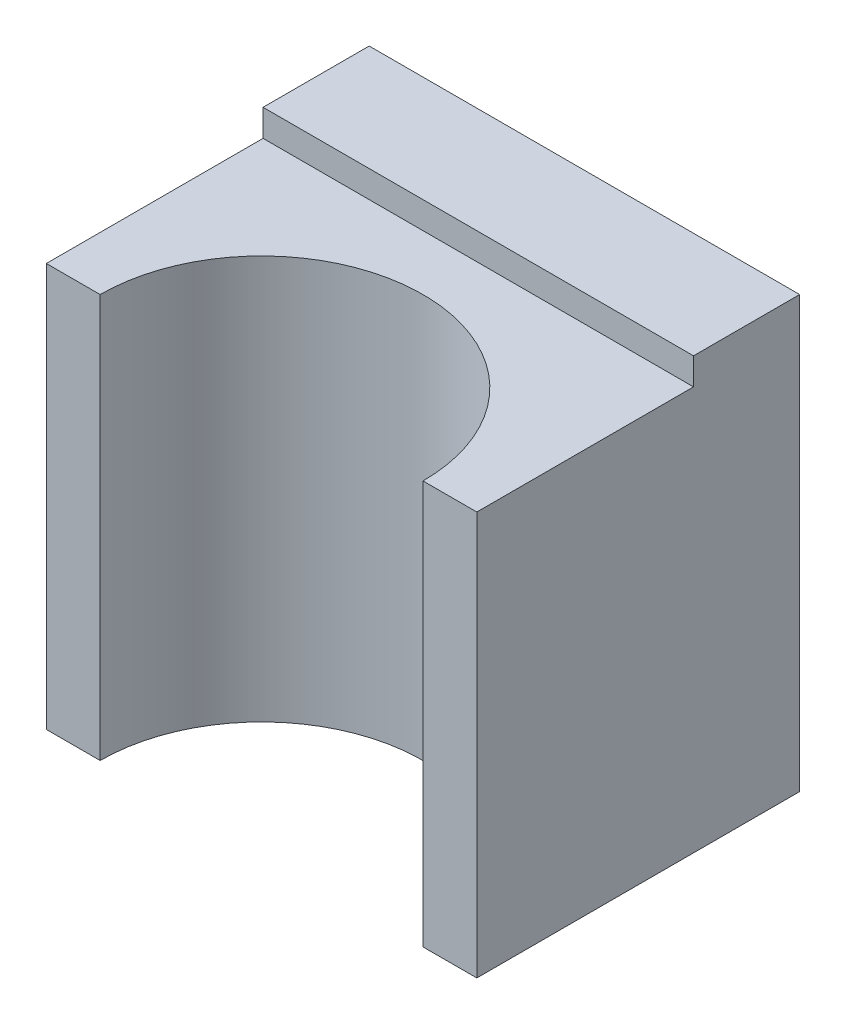
ISO-10303-21;
HEADER;
FILE_DESCRIPTION(('STEP AP214'),'2;1');
FILE_NAME('part.step','',(''),(''),'','','');
FILE_SCHEMA(('AUTOMOTIVE_DESIGN { 1 0 10303 214 1 1 1 1 }'));
ENDSEC;
DATA;
#1=APPLICATION_CONTEXT('core data for automotive mechanical design processes');
#2=APPLICATION_PROTOCOL_DEFINITION('international standard','automotive_design',2000,#1);
#3=PRODUCT_CONTEXT('',#1,'mechanical');
#4=PRODUCT('Part','Part','',(#3));
#5=PRODUCT_RELATED_PRODUCT_CATEGORY('part','',(#4));
#6=PRODUCT_DEFINITION_FORMATION('','',#4);
#7=PRODUCT_DEFINITION_CONTEXT('part definition',#1,'design');
#8=PRODUCT_DEFINITION('design','',#6,#7);
#9=PRODUCT_DEFINITION_SHAPE('','',#8);
#10=(LENGTH_UNIT() NAMED_UNIT(*) SI_UNIT(.MILLI.,.METRE.));
#11=(NAMED_UNIT(*) PLANE_ANGLE_UNIT() SI_UNIT($,.RADIAN.));
#12=(NAMED_UNIT(*) SI_UNIT($,.STERADIAN.) SOLID_ANGLE_UNIT());
#13=UNCERTAINTY_MEASURE_WITH_UNIT(LENGTH_MEASURE(1.E-05),#10,'distance_accuracy_value','');
#14=(GEOMETRIC_REPRESENTATION_CONTEXT(3) GLOBAL_UNCERTAINTY_ASSIGNED_CONTEXT((#13)) GLOBAL_UNIT_ASSIGNED_CONTEXT((#10,
#11,#12)) REPRESENTATION_CONTEXT('',''));
#15=CARTESIAN_POINT('',(0.,0.,0.));
#16=DIRECTION('',(0.,0.,1.));
#17=DIRECTION('',(1.,0.,0.));
#18=AXIS2_PLACEMENT_3D('',#15,#16,#17);
#19=CARTESIAN_POINT('',(0.,0.,30.));
#20=DIRECTION('',(0.,0.,-1.));
#21=DIRECTION('',(-1.,0.,0.));
#22=AXIS2_PLACEMENT_3D('',#19,#20,#21);
#23=PLANE('',#22);
#24=DIRECTION('',(0.,1.,0.));
#25=VECTOR('',#24,1.);
#26=CARTESIAN_POINT('',(-10.,45.,30.));
#27=LINE('',#26,#25);
#28=CARTESIAN_POINT('',(-10.,5.,30.));
#29=VERTEX_POINT('',#28);
#30=CARTESIAN_POINT('',(-10.,42.5,30.));
#31=VERTEX_POINT('',#30);
#32=EDGE_CURVE('E151',#29,#31,#27,.T.);
#33=ORIENTED_EDGE('',*,*,#32,.T.);
#34=DIRECTION('',(1.,0.,0.));
#35=VECTOR('',#34,1.);
#36=CARTESIAN_POINT('',(-10.,42.5,30.));
#37=LINE('',#36,#35);
#38=CARTESIAN_POINT('',(-15.,42.5,30.));
#39=VERTEX_POINT('',#38);
#40=EDGE_CURVE('E158',#39,#31,#37,.T.);
#41=ORIENTED_EDGE('',*,*,#40,.F.);
#42=DIRECTION('',(0.,-1.,0.));
#43=VECTOR('',#42,1.);
#44=CARTESIAN_POINT('',(-15.,45.,30.));
#45=LINE('',#44,#43);
#46=CARTESIAN_POINT('',(-15.,5.,30.));
#47=VERTEX_POINT('',#46);
#48=EDGE_CURVE('E11',#39,#47,#45,.T.);
#49=ORIENTED_EDGE('',*,*,#48,.T.);
#50=DIRECTION('',(1.,0.,0.));
#51=VECTOR('',#50,1.);
#52=CARTESIAN_POINT('',(-10.,5.,30.));
#53=LINE('',#52,#51);
#54=EDGE_CURVE('E96',#47,#29,#53,.T.);
#55=ORIENTED_EDGE('',*,*,#54,.T.);
#56=EDGE_LOOP('',(#33,#41,#49,#55));
#57=FACE_BOUND('',#56,.T.);
#58=ADVANCED_FACE('F39',(#57),#23,.F.);
#59=CARTESIAN_POINT('',(-10.,5.,30.));
#60=DIRECTION('',(0.,1.,0.));
#61=DIRECTION('',(-1.,0.,0.));
#62=AXIS2_PLACEMENT_3D('',#59,#60,#61);
#63=PLANE('',#62);
#64=ORIENTED_EDGE('',*,*,#54,.F.);
#65=CARTESIAN_POINT('',(-30.,5.,30.));
#66=DIRECTION('',(0.,-1.,0.));
#67=DIRECTION('',(1.,0.,0.));
#68=AXIS2_PLACEMENT_3D('',#65,#66,#67);
#69=CIRCLE('',#68,15.);
#70=CARTESIAN_POINT('',(-45.,5.,30.));
#71=VERTEX_POINT('',#70);
#72=EDGE_CURVE('E113',#71,#47,#69,.T.);
#73=ORIENTED_EDGE('',*,*,#72,.F.);
#74=CARTESIAN_POINT('',(-50.,5.,30.));
#75=VERTEX_POINT('',#74);
#76=EDGE_CURVE('E105',#75,#71,#53,.T.);
#77=ORIENTED_EDGE('',*,*,#76,.F.);
#78=DIRECTION('',(0.,0.,-1.));
#79=VECTOR('',#78,1.);
#80=CARTESIAN_POINT('',(-50.,5.,30.));
#81=LINE('',#80,#79);
#82=CARTESIAN_POINT('',(-50.,5.,0.));
#83=VERTEX_POINT('',#82);
#84=EDGE_CURVE('E86',#75,#83,#81,.T.);
#85=ORIENTED_EDGE('',*,*,#84,.T.);
#86=DIRECTION('',(1.,0.,0.));
#87=VECTOR('',#86,1.);
#88=CARTESIAN_POINT('',(-10.,5.,0.));
#89=LINE('',#88,#87);
#90=CARTESIAN_POINT('',(-10.,5.,0.));
#91=VERTEX_POINT('',#90);
#92=EDGE_CURVE('E103',#83,#91,#89,.T.);
#93=ORIENTED_EDGE('',*,*,#92,.T.);
#94=DIRECTION('',(0.,0.,-1.));
#95=VECTOR('',#94,1.);
#96=CARTESIAN_POINT('',(-10.,5.,30.));
#97=LINE('',#96,#95);
#98=EDGE_CURVE('E131',#29,#91,#97,.T.);
#99=ORIENTED_EDGE('',*,*,#98,.F.);
#100=EDGE_LOOP('',(#64,#73,#77,#85,#93,#99));
#101=FACE_BOUND('',#100,.T.);
#102=ADVANCED_FACE('F41',(#101),#63,.F.);
#103=CARTESIAN_POINT('',(-10.,45.,30.));
#104=DIRECTION('',(-1.,0.,0.));
#105=DIRECTION('',(0.,-1.,0.));
#106=AXIS2_PLACEMENT_3D('',#103,#104,#105);
#107=PLANE('',#106);
#108=DIRECTION('',(0.,0.,-1.));
#109=VECTOR('',#108,1.);
#110=CARTESIAN_POINT('',(-10.,45.,30.));
#111=LINE('',#110,#109);
#112=CARTESIAN_POINT('',(-10.,45.,9.86245708082834));
#113=VERTEX_POINT('',#112);
#114=CARTESIAN_POINT('',(-10.,45.,0.));
#115=VERTEX_POINT('',#114);
#116=EDGE_CURVE('E128',#113,#115,#111,.T.);
#117=ORIENTED_EDGE('',*,*,#116,.F.);
#118=DIRECTION('',(0.,1.,0.));
#119=VECTOR('',#118,1.);
#120=CARTESIAN_POINT('',(-10.,42.5,9.86245708082834));
#121=LINE('',#120,#119);
#122=CARTESIAN_POINT('',(-10.,42.5,9.86245708082834));
#123=VERTEX_POINT('',#122);
#124=EDGE_CURVE('E169',#123,#113,#121,.T.);
#125=ORIENTED_EDGE('',*,*,#124,.F.);
#126=DIRECTION('',(0.,0.,-1.));
#127=VECTOR('',#126,1.);
#128=CARTESIAN_POINT('',(-10.,42.5,9.86245708082834));
#129=LINE('',#128,#127);
#130=EDGE_CURVE('E166',#31,#123,#129,.T.);
#131=ORIENTED_EDGE('',*,*,#130,.F.);
#132=ORIENTED_EDGE('',*,*,#32,.F.);
#133=ORIENTED_EDGE('',*,*,#98,.T.);
#134=DIRECTION('',(0.,1.,0.));
#135=VECTOR('',#134,1.);
#136=CARTESIAN_POINT('',(-10.,45.,0.));
#137=LINE('',#136,#135);
#138=EDGE_CURVE('E110',#91,#115,#137,.T.);
#139=ORIENTED_EDGE('',*,*,#138,.T.);
#140=EDGE_LOOP('',(#117,#125,#131,#132,#133,#139));
#141=FACE_BOUND('',#140,.T.);
#142=ADVANCED_FACE('F163',(#141),#107,.F.);
#143=CARTESIAN_POINT('',(-50.,45.,30.));
#144=DIRECTION('',(0.,-1.,0.));
#145=DIRECTION('',(0.,0.,-1.));
#146=AXIS2_PLACEMENT_3D('',#143,#144,#145);
#147=PLANE('',#146);
#148=DIRECTION('',(0.,0.,-1.));
#149=VECTOR('',#148,1.);
#150=CARTESIAN_POINT('',(-50.,45.,30.));
#151=LINE('',#150,#149);
#152=CARTESIAN_POINT('',(-50.,45.,9.86245708082834));
#153=VERTEX_POINT('',#152);
#154=CARTESIAN_POINT('',(-50.,45.,0.));
#155=VERTEX_POINT('',#154);
#156=EDGE_CURVE('E90',#153,#155,#151,.T.);
#157=ORIENTED_EDGE('',*,*,#156,.F.);
#158=DIRECTION('',(-1.,0.,0.));
#159=VECTOR('',#158,1.);
#160=CARTESIAN_POINT('',(-50.,45.,9.86245708082834));
#161=LINE('',#160,#159);
#162=EDGE_CURVE('E173',#113,#153,#161,.T.);
#163=ORIENTED_EDGE('',*,*,#162,.F.);
#164=ORIENTED_EDGE('',*,*,#116,.T.);
#165=DIRECTION('',(-1.,0.,0.));
#166=VECTOR('',#165,1.);
#167=CARTESIAN_POINT('',(-50.,45.,0.));
#168=LINE('',#167,#166);
#169=EDGE_CURVE('E97',#115,#155,#168,.T.);
#170=ORIENTED_EDGE('',*,*,#169,.T.);
#171=EDGE_LOOP('',(#157,#163,#164,#170));
#172=FACE_BOUND('',#171,.T.);
#173=ADVANCED_FACE('F201',(#172),#147,.F.);
#174=CARTESIAN_POINT('',(-50.,5.,30.));
#175=DIRECTION('',(1.,0.,0.));
#176=DIRECTION('',(0.,0.,-1.));
#177=AXIS2_PLACEMENT_3D('',#174,#175,#176);
#178=PLANE('',#177);
#179=DIRECTION('',(0.,0.,1.));
#180=VECTOR('',#179,1.);
#181=CARTESIAN_POINT('',(-50.,42.5,30.));
#182=LINE('',#181,#180);
#183=CARTESIAN_POINT('',(-50.,42.5,9.86245708082834));
#184=VERTEX_POINT('',#183);
#185=CARTESIAN_POINT('',(-50.,42.5,30.));
#186=VERTEX_POINT('',#185);
#187=EDGE_CURVE('E177',#184,#186,#182,.T.);
#188=ORIENTED_EDGE('',*,*,#187,.F.);
#189=DIRECTION('',(0.,1.,0.));
#190=VECTOR('',#189,1.);
#191=CARTESIAN_POINT('',(-50.,42.5,9.86245708082834));
#192=LINE('',#191,#190);
#193=EDGE_CURVE('E119',#184,#153,#192,.T.);
#194=ORIENTED_EDGE('',*,*,#193,.T.);
#195=ORIENTED_EDGE('',*,*,#156,.T.);
#196=DIRECTION('',(0.,-1.,0.));
#197=VECTOR('',#196,1.);
#198=CARTESIAN_POINT('',(-50.,5.,0.));
#199=LINE('',#198,#197);
#200=EDGE_CURVE('E82',#155,#83,#199,.T.);
#201=ORIENTED_EDGE('',*,*,#200,.T.);
#202=ORIENTED_EDGE('',*,*,#84,.F.);
#203=DIRECTION('',(0.,-1.,0.));
#204=VECTOR('',#203,1.);
#205=CARTESIAN_POINT('',(-50.,5.,30.));
#206=LINE('',#205,#204);
#207=EDGE_CURVE('E63',#186,#75,#206,.T.);
#208=ORIENTED_EDGE('',*,*,#207,.F.);
#209=EDGE_LOOP('',(#188,#194,#195,#201,#202,#208));
#210=FACE_BOUND('',#209,.T.);
#211=ADVANCED_FACE('F85',(#210),#178,.F.);
#212=DIRECTION('',(0.,-1.,0.));
#213=VECTOR('',#212,1.);
#214=CARTESIAN_POINT('',(-45.,45.,30.));
#215=LINE('',#214,#213);
#216=CARTESIAN_POINT('',(-45.,42.5,30.));
#217=VERTEX_POINT('',#216);
#218=EDGE_CURVE('E48',#71,#217,#215,.F.);
#219=ORIENTED_EDGE('',*,*,#218,.T.);
#220=DIRECTION('',(1.,0.,0.));
#221=VECTOR('',#220,1.);
#222=CARTESIAN_POINT('',(-45.,42.5,30.));
#223=LINE('',#222,#221);
#224=EDGE_CURVE('E55',#186,#217,#223,.T.);
#225=ORIENTED_EDGE('',*,*,#224,.F.);
#226=ORIENTED_EDGE('',*,*,#207,.T.);
#227=ORIENTED_EDGE('',*,*,#76,.T.);
#228=EDGE_LOOP('',(#219,#225,#226,#227));
#229=FACE_BOUND('',#228,.T.);
#230=ADVANCED_FACE('F136',(#229),#23,.F.);
#231=CARTESIAN_POINT('',(0.,0.,0.));
#232=DIRECTION('',(0.,0.,-1.));
#233=DIRECTION('',(-1.,0.,0.));
#234=AXIS2_PLACEMENT_3D('',#231,#232,#233);
#235=PLANE('',#234);
#236=ORIENTED_EDGE('',*,*,#92,.F.);
#237=ORIENTED_EDGE('',*,*,#200,.F.);
#238=ORIENTED_EDGE('',*,*,#169,.F.);
#239=ORIENTED_EDGE('',*,*,#138,.F.);
#240=EDGE_LOOP('',(#236,#237,#238,#239));
#241=FACE_BOUND('',#240,.T.);
#242=ADVANCED_FACE('F108',(#241),#235,.T.);
#243=CARTESIAN_POINT('',(-30.,45.,30.));
#244=DIRECTION('',(0.,-1.,0.));
#245=DIRECTION('',(1.,0.,0.));
#246=AXIS2_PLACEMENT_3D('',#243,#244,#245);
#247=CYLINDRICAL_SURFACE('',#246,15.);
#248=ORIENTED_EDGE('',*,*,#48,.F.);
#249=CARTESIAN_POINT('',(-30.,42.5,30.));
#250=DIRECTION('',(0.,-1.,0.));
#251=DIRECTION('',(0.,0.,-1.));
#252=AXIS2_PLACEMENT_3D('',#249,#250,#251);
#253=CIRCLE('',#252,15.);
#254=EDGE_CURVE('E142',#217,#39,#253,.T.);
#255=ORIENTED_EDGE('',*,*,#254,.F.);
#256=ORIENTED_EDGE('',*,*,#218,.F.);
#257=ORIENTED_EDGE('',*,*,#72,.T.);
#258=EDGE_LOOP('',(#248,#255,#256,#257));
#259=FACE_BOUND('',#258,.T.);
#260=ADVANCED_FACE('F140',(#259),#247,.F.);
#261=CARTESIAN_POINT('',(-50.,42.5,9.86245708082834));
#262=DIRECTION('',(0.,0.,-1.));
#263=DIRECTION('',(-1.,0.,0.));
#264=AXIS2_PLACEMENT_3D('',#261,#262,#263);
#265=PLANE('',#264);
#266=ORIENTED_EDGE('',*,*,#162,.T.);
#267=ORIENTED_EDGE('',*,*,#193,.F.);
#268=DIRECTION('',(-1.,0.,0.));
#269=VECTOR('',#268,1.);
#270=CARTESIAN_POINT('',(-50.,42.5,9.86245708082834));
#271=LINE('',#270,#269);
#272=EDGE_CURVE('E172',#123,#184,#271,.T.);
#273=ORIENTED_EDGE('',*,*,#272,.F.);
#274=ORIENTED_EDGE('',*,*,#124,.T.);
#275=EDGE_LOOP('',(#266,#267,#273,#274));
#276=FACE_BOUND('',#275,.T.);
#277=ADVANCED_FACE('F196',(#276),#265,.F.);
#278=CARTESIAN_POINT('',(-30.,42.5,30.));
#279=DIRECTION('',(0.,-1.,0.));
#280=DIRECTION('',(0.,0.,-1.));
#281=AXIS2_PLACEMENT_3D('',#278,#279,#280);
#282=PLANE('',#281);
#283=ORIENTED_EDGE('',*,*,#130,.T.);
#284=ORIENTED_EDGE('',*,*,#272,.T.);
#285=ORIENTED_EDGE('',*,*,#187,.T.);
#286=ORIENTED_EDGE('',*,*,#224,.T.);
#287=ORIENTED_EDGE('',*,*,#254,.T.);
#288=ORIENTED_EDGE('',*,*,#40,.T.);
#289=EDGE_LOOP('',(#283,#284,#285,#286,#287,#288));
#290=FACE_BOUND('',#289,.T.);
#291=ADVANCED_FACE('F208',(#290),#282,.F.);
#292=CLOSED_SHELL('',(#58,#102,#142,#173,#211,#230,#242,#260,#277,#291));
#293=MANIFOLD_SOLID_BREP('B2',#292);
#294=ADVANCED_BREP_SHAPE_REPRESENTATION('',(#18,#293),#14);
#295=SHAPE_DEFINITION_REPRESENTATION(#9,#294);
ENDSEC;
END-ISO-10303-21;
